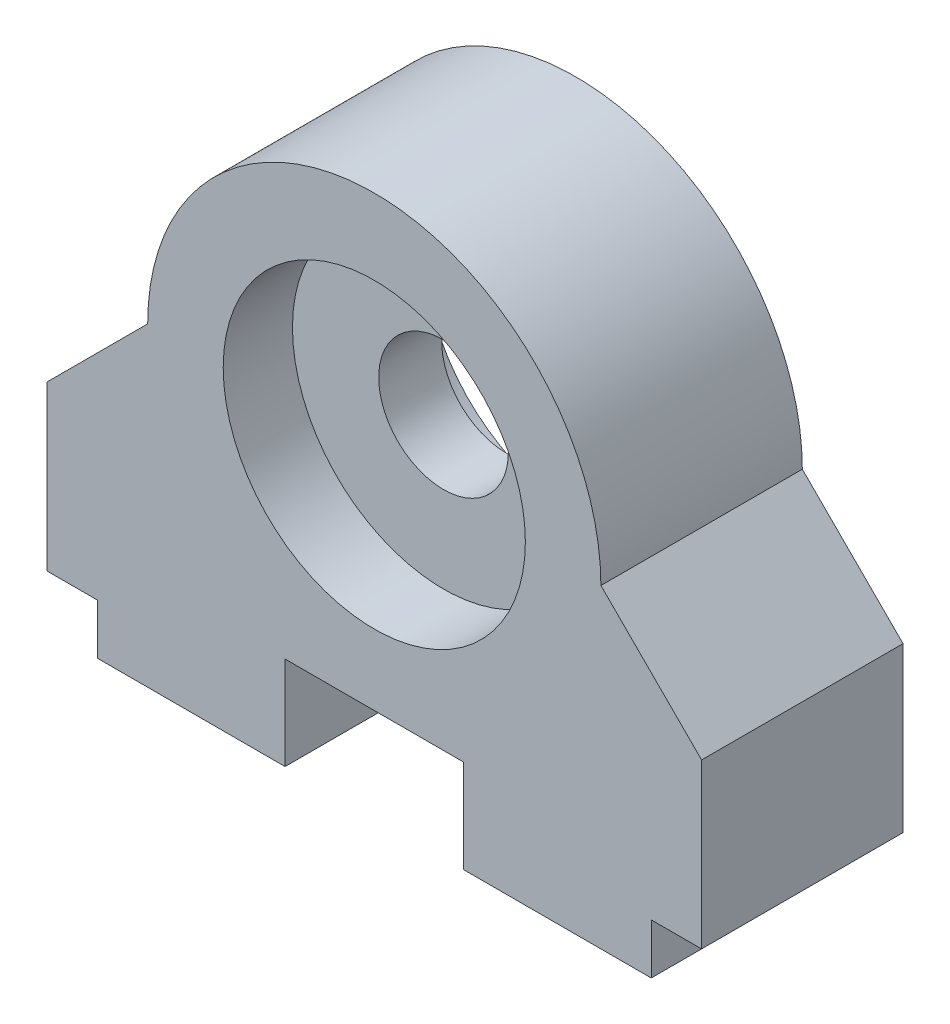
ISO-10303-21;
HEADER;
FILE_DESCRIPTION(('STEP AP214'),'2;1');
FILE_NAME('part.step','',(''),(''),'','','');
FILE_SCHEMA(('AUTOMOTIVE_DESIGN { 1 0 10303 214 1 1 1 1 }'));
ENDSEC;
DATA;
#1=APPLICATION_CONTEXT('core data for automotive mechanical design processes');
#2=APPLICATION_PROTOCOL_DEFINITION('international standard','automotive_design',2000,#1);
#3=PRODUCT_CONTEXT('',#1,'mechanical');
#4=PRODUCT('Part','Part','',(#3));
#5=PRODUCT_RELATED_PRODUCT_CATEGORY('part','',(#4));
#6=PRODUCT_DEFINITION_FORMATION('','',#4);
#7=PRODUCT_DEFINITION_CONTEXT('part definition',#1,'design');
#8=PRODUCT_DEFINITION('design','',#6,#7);
#9=PRODUCT_DEFINITION_SHAPE('','',#8);
#10=(LENGTH_UNIT() NAMED_UNIT(*) SI_UNIT(.MILLI.,.METRE.));
#11=(NAMED_UNIT(*) PLANE_ANGLE_UNIT() SI_UNIT($,.RADIAN.));
#12=(NAMED_UNIT(*) SI_UNIT($,.STERADIAN.) SOLID_ANGLE_UNIT());
#13=UNCERTAINTY_MEASURE_WITH_UNIT(LENGTH_MEASURE(1.E-05),#10,'distance_accuracy_value','');
#14=(GEOMETRIC_REPRESENTATION_CONTEXT(3) GLOBAL_UNCERTAINTY_ASSIGNED_CONTEXT((#13)) GLOBAL_UNIT_ASSIGNED_CONTEXT((#10,
#11,#12)) REPRESENTATION_CONTEXT('',''));
#15=CARTESIAN_POINT('',(0.,0.,0.));
#16=DIRECTION('',(0.,0.,1.));
#17=DIRECTION('',(1.,0.,0.));
#18=AXIS2_PLACEMENT_3D('',#15,#16,#17);
#19=CARTESIAN_POINT('',(0.,15.875,10.16));
#20=DIRECTION('',(0.,0.,-1.));
#21=DIRECTION('',(-1.,0.,0.));
#22=AXIS2_PLACEMENT_3D('',#19,#20,#21);
#23=CYLINDRICAL_SURFACE('',#22,7.62);
#24=CARTESIAN_POINT('',(0.,15.875,0.));
#25=DIRECTION('',(0.,0.,1.));
#26=DIRECTION('',(1.,0.,0.));
#27=AXIS2_PLACEMENT_3D('',#24,#25,#26);
#28=CIRCLE('',#27,7.62);
#29=CARTESIAN_POINT('',(7.62,15.875,0.));
#30=VERTEX_POINT('',#29);
#31=EDGE_CURVE('E330',#30,#30,#28,.T.);
#32=ORIENTED_EDGE('',*,*,#31,.F.);
#33=EDGE_LOOP('',(#32));
#34=FACE_BOUND('',#33,.T.);
#35=CARTESIAN_POINT('',(0.,15.875,3.4925));
#36=DIRECTION('',(0.,0.,1.));
#37=DIRECTION('',(1.,0.,0.));
#38=AXIS2_PLACEMENT_3D('',#35,#36,#37);
#39=CIRCLE('',#38,7.62);
#40=CARTESIAN_POINT('',(7.62,15.875,3.4925));
#41=VERTEX_POINT('',#40);
#42=EDGE_CURVE('E37',#41,#41,#39,.T.);
#43=ORIENTED_EDGE('',*,*,#42,.T.);
#44=EDGE_LOOP('',(#43));
#45=FACE_BOUND('',#44,.T.);
#46=ADVANCED_FACE('F33',(#34,#45),#23,.F.);
#47=CARTESIAN_POINT('',(0.,15.875,10.16));
#48=DIRECTION('',(0.,0.,-1.));
#49=DIRECTION('',(-1.,0.,0.));
#50=AXIS2_PLACEMENT_3D('',#47,#48,#49);
#51=PLANE('',#50);
#52=DIRECTION('',(0.,-1.,0.));
#53=VECTOR('',#52,1.);
#54=CARTESIAN_POINT('',(-13.97,0.,10.16));
#55=LINE('',#54,#53);
#56=CARTESIAN_POINT('',(-13.97,2.54,10.16));
#57=VERTEX_POINT('',#56);
#58=CARTESIAN_POINT('',(-13.97,0.,10.16));
#59=VERTEX_POINT('',#58);
#60=EDGE_CURVE('E196',#57,#59,#55,.T.);
#61=ORIENTED_EDGE('',*,*,#60,.T.);
#62=DIRECTION('',(1.,0.,0.));
#63=VECTOR('',#62,1.);
#64=CARTESIAN_POINT('',(-4.5,0.,10.16));
#65=LINE('',#64,#63);
#66=CARTESIAN_POINT('',(-4.5,0.,10.16));
#67=VERTEX_POINT('',#66);
#68=EDGE_CURVE('E113',#59,#67,#65,.T.);
#69=ORIENTED_EDGE('',*,*,#68,.T.);
#70=DIRECTION('',(0.,1.,0.));
#71=VECTOR('',#70,1.);
#72=CARTESIAN_POINT('',(-4.5,4.699,10.16));
#73=LINE('',#72,#71);
#74=CARTESIAN_POINT('',(-4.5,4.699,10.16));
#75=VERTEX_POINT('',#74);
#76=EDGE_CURVE('E249',#67,#75,#73,.T.);
#77=ORIENTED_EDGE('',*,*,#76,.T.);
#78=DIRECTION('',(1.,0.,0.));
#79=VECTOR('',#78,1.);
#80=CARTESIAN_POINT('',(4.5,4.699,10.16));
#81=LINE('',#80,#79);
#82=CARTESIAN_POINT('',(4.5,4.699,10.16));
#83=VERTEX_POINT('',#82);
#84=EDGE_CURVE('E246',#75,#83,#81,.T.);
#85=ORIENTED_EDGE('',*,*,#84,.T.);
#86=DIRECTION('',(0.,-1.,0.));
#87=VECTOR('',#86,1.);
#88=CARTESIAN_POINT('',(4.5,4.699,10.16));
#89=LINE('',#88,#87);
#90=CARTESIAN_POINT('',(4.5,0.,10.16));
#91=VERTEX_POINT('',#90);
#92=EDGE_CURVE('E248',#83,#91,#89,.T.);
#93=ORIENTED_EDGE('',*,*,#92,.T.);
#94=DIRECTION('',(1.,0.,0.));
#95=VECTOR('',#94,1.);
#96=CARTESIAN_POINT('',(4.5,0.,10.16));
#97=LINE('',#96,#95);
#98=CARTESIAN_POINT('',(13.97,0.,10.16));
#99=VERTEX_POINT('',#98);
#100=EDGE_CURVE('E251',#91,#99,#97,.T.);
#101=ORIENTED_EDGE('',*,*,#100,.T.);
#102=DIRECTION('',(0.,1.,0.));
#103=VECTOR('',#102,1.);
#104=CARTESIAN_POINT('',(13.97,0.,10.16));
#105=LINE('',#104,#103);
#106=CARTESIAN_POINT('',(13.97,2.54,10.16));
#107=VERTEX_POINT('',#106);
#108=EDGE_CURVE('E257',#99,#107,#105,.T.);
#109=ORIENTED_EDGE('',*,*,#108,.T.);
#110=DIRECTION('',(1.,0.,0.));
#111=VECTOR('',#110,1.);
#112=CARTESIAN_POINT('',(16.51,2.54,10.16));
#113=LINE('',#112,#111);
#114=CARTESIAN_POINT('',(16.51,2.54,10.16));
#115=VERTEX_POINT('',#114);
#116=EDGE_CURVE('E259',#107,#115,#113,.T.);
#117=ORIENTED_EDGE('',*,*,#116,.T.);
#118=DIRECTION('',(0.,1.,0.));
#119=VECTOR('',#118,1.);
#120=CARTESIAN_POINT('',(16.51,2.54,10.16));
#121=LINE('',#120,#119);
#122=CARTESIAN_POINT('',(16.51,10.795,10.16));
#123=VERTEX_POINT('',#122);
#124=EDGE_CURVE('E261',#115,#123,#121,.T.);
#125=ORIENTED_EDGE('',*,*,#124,.T.);
#126=DIRECTION('',(-0.707106781186549,0.707106781186546,0.));
#127=VECTOR('',#126,1.);
#128=CARTESIAN_POINT('',(16.51,10.795,10.16));
#129=LINE('',#128,#127);
#130=CARTESIAN_POINT('',(11.43,15.875,10.16));
#131=VERTEX_POINT('',#130);
#132=EDGE_CURVE('E263',#123,#131,#129,.T.);
#133=ORIENTED_EDGE('',*,*,#132,.T.);
#134=CARTESIAN_POINT('',(0.,15.875,10.16));
#135=DIRECTION('',(0.,0.,1.));
#136=DIRECTION('',(-1.,0.,0.));
#137=AXIS2_PLACEMENT_3D('',#134,#135,#136);
#138=CIRCLE('',#137,11.43);
#139=CARTESIAN_POINT('',(-11.43,15.875,10.16));
#140=VERTEX_POINT('',#139);
#141=EDGE_CURVE('E151',#131,#140,#138,.T.);
#142=ORIENTED_EDGE('',*,*,#141,.T.);
#143=DIRECTION('',(-0.707106781186549,-0.707106781186546,0.));
#144=VECTOR('',#143,1.);
#145=CARTESIAN_POINT('',(-16.51,10.795,10.16));
#146=LINE('',#145,#144);
#147=CARTESIAN_POINT('',(-16.51,10.795,10.16));
#148=VERTEX_POINT('',#147);
#149=EDGE_CURVE('E144',#140,#148,#146,.T.);
#150=ORIENTED_EDGE('',*,*,#149,.T.);
#151=DIRECTION('',(0.,-1.,0.));
#152=VECTOR('',#151,1.);
#153=CARTESIAN_POINT('',(-16.51,2.54,10.16));
#154=LINE('',#153,#152);
#155=CARTESIAN_POINT('',(-16.51,2.54,10.16));
#156=VERTEX_POINT('',#155);
#157=EDGE_CURVE('E149',#148,#156,#154,.T.);
#158=ORIENTED_EDGE('',*,*,#157,.T.);
#159=DIRECTION('',(1.,0.,0.));
#160=VECTOR('',#159,1.);
#161=CARTESIAN_POINT('',(-16.51,2.54,10.16));
#162=LINE('',#161,#160);
#163=EDGE_CURVE('E51',#156,#57,#162,.T.);
#164=ORIENTED_EDGE('',*,*,#163,.T.);
#165=EDGE_LOOP('',(#61,#69,#77,#85,#93,#101,#109,#117,#125,#133,#142,#150,#158,#164));
#166=FACE_BOUND('',#165,.T.);
#167=CARTESIAN_POINT('',(0.,15.875,10.16));
#168=DIRECTION('',(0.,0.,1.));
#169=DIRECTION('',(1.,0.,0.));
#170=AXIS2_PLACEMENT_3D('',#167,#168,#169);
#171=CIRCLE('',#170,7.62);
#172=CARTESIAN_POINT('',(7.62,15.875,10.16));
#173=VERTEX_POINT('',#172);
#174=EDGE_CURVE('E173',#173,#173,#171,.T.);
#175=ORIENTED_EDGE('',*,*,#174,.F.);
#176=EDGE_LOOP('',(#175));
#177=FACE_BOUND('',#176,.T.);
#178=ADVANCED_FACE('F146',(#166,#177),#51,.F.);
#179=CARTESIAN_POINT('',(0.,15.875,0.));
#180=DIRECTION('',(0.,0.,-1.));
#181=DIRECTION('',(-1.,0.,0.));
#182=AXIS2_PLACEMENT_3D('',#179,#180,#181);
#183=PLANE('',#182);
#184=DIRECTION('',(0.,-1.,0.));
#185=VECTOR('',#184,1.);
#186=CARTESIAN_POINT('',(-13.97,0.,0.));
#187=LINE('',#186,#185);
#188=CARTESIAN_POINT('',(-13.97,2.54,0.));
#189=VERTEX_POINT('',#188);
#190=CARTESIAN_POINT('',(-13.97,0.,0.));
#191=VERTEX_POINT('',#190);
#192=EDGE_CURVE('E169',#189,#191,#187,.T.);
#193=ORIENTED_EDGE('',*,*,#192,.F.);
#194=DIRECTION('',(1.,0.,0.));
#195=VECTOR('',#194,1.);
#196=CARTESIAN_POINT('',(-16.51,2.54,0.));
#197=LINE('',#196,#195);
#198=CARTESIAN_POINT('',(-16.51,2.54,0.));
#199=VERTEX_POINT('',#198);
#200=EDGE_CURVE('E104',#199,#189,#197,.T.);
#201=ORIENTED_EDGE('',*,*,#200,.F.);
#202=DIRECTION('',(0.,-1.,0.));
#203=VECTOR('',#202,1.);
#204=CARTESIAN_POINT('',(-16.51,2.54,0.));
#205=LINE('',#204,#203);
#206=CARTESIAN_POINT('',(-16.51,10.795,0.));
#207=VERTEX_POINT('',#206);
#208=EDGE_CURVE('E98',#207,#199,#205,.T.);
#209=ORIENTED_EDGE('',*,*,#208,.F.);
#210=DIRECTION('',(-0.707106781186549,-0.707106781186546,0.));
#211=VECTOR('',#210,1.);
#212=CARTESIAN_POINT('',(-16.51,10.795,0.));
#213=LINE('',#212,#211);
#214=CARTESIAN_POINT('',(-11.43,15.875,0.));
#215=VERTEX_POINT('',#214);
#216=EDGE_CURVE('E159',#215,#207,#213,.T.);
#217=ORIENTED_EDGE('',*,*,#216,.F.);
#218=CARTESIAN_POINT('',(0.,15.875,0.));
#219=DIRECTION('',(0.,0.,1.));
#220=DIRECTION('',(-1.,0.,0.));
#221=AXIS2_PLACEMENT_3D('',#218,#219,#220);
#222=CIRCLE('',#221,11.43);
#223=CARTESIAN_POINT('',(11.43,15.875,0.));
#224=VERTEX_POINT('',#223);
#225=EDGE_CURVE('E191',#224,#215,#222,.T.);
#226=ORIENTED_EDGE('',*,*,#225,.F.);
#227=DIRECTION('',(-0.707106781186549,0.707106781186546,0.));
#228=VECTOR('',#227,1.);
#229=CARTESIAN_POINT('',(16.51,10.795,0.));
#230=LINE('',#229,#228);
#231=CARTESIAN_POINT('',(16.51,10.795,0.));
#232=VERTEX_POINT('',#231);
#233=EDGE_CURVE('E189',#232,#224,#230,.T.);
#234=ORIENTED_EDGE('',*,*,#233,.F.);
#235=DIRECTION('',(0.,1.,0.));
#236=VECTOR('',#235,1.);
#237=CARTESIAN_POINT('',(16.51,2.54,0.));
#238=LINE('',#237,#236);
#239=CARTESIAN_POINT('',(16.51,2.54,0.));
#240=VERTEX_POINT('',#239);
#241=EDGE_CURVE('E187',#240,#232,#238,.T.);
#242=ORIENTED_EDGE('',*,*,#241,.F.);
#243=DIRECTION('',(1.,0.,0.));
#244=VECTOR('',#243,1.);
#245=CARTESIAN_POINT('',(16.51,2.54,0.));
#246=LINE('',#245,#244);
#247=CARTESIAN_POINT('',(13.97,2.54,0.));
#248=VERTEX_POINT('',#247);
#249=EDGE_CURVE('E185',#248,#240,#246,.T.);
#250=ORIENTED_EDGE('',*,*,#249,.F.);
#251=DIRECTION('',(0.,1.,0.));
#252=VECTOR('',#251,1.);
#253=CARTESIAN_POINT('',(13.97,0.,0.));
#254=LINE('',#253,#252);
#255=CARTESIAN_POINT('',(13.97,0.,0.));
#256=VERTEX_POINT('',#255);
#257=EDGE_CURVE('E183',#256,#248,#254,.T.);
#258=ORIENTED_EDGE('',*,*,#257,.F.);
#259=DIRECTION('',(1.,0.,0.));
#260=VECTOR('',#259,1.);
#261=CARTESIAN_POINT('',(4.5,0.,0.));
#262=LINE('',#261,#260);
#263=CARTESIAN_POINT('',(4.5,0.,0.));
#264=VERTEX_POINT('',#263);
#265=EDGE_CURVE('E181',#264,#256,#262,.T.);
#266=ORIENTED_EDGE('',*,*,#265,.F.);
#267=DIRECTION('',(0.,-1.,0.));
#268=VECTOR('',#267,1.);
#269=CARTESIAN_POINT('',(4.5,4.699,0.));
#270=LINE('',#269,#268);
#271=CARTESIAN_POINT('',(4.5,4.699,0.));
#272=VERTEX_POINT('',#271);
#273=EDGE_CURVE('E179',#272,#264,#270,.T.);
#274=ORIENTED_EDGE('',*,*,#273,.F.);
#275=DIRECTION('',(1.,0.,0.));
#276=VECTOR('',#275,1.);
#277=CARTESIAN_POINT('',(4.5,4.699,0.));
#278=LINE('',#277,#276);
#279=CARTESIAN_POINT('',(-4.5,4.699,0.));
#280=VERTEX_POINT('',#279);
#281=EDGE_CURVE('E177',#280,#272,#278,.T.);
#282=ORIENTED_EDGE('',*,*,#281,.F.);
#283=DIRECTION('',(0.,1.,0.));
#284=VECTOR('',#283,1.);
#285=CARTESIAN_POINT('',(-4.5,4.699,0.));
#286=LINE('',#285,#284);
#287=CARTESIAN_POINT('',(-4.5,0.,0.));
#288=VERTEX_POINT('',#287);
#289=EDGE_CURVE('E175',#288,#280,#286,.T.);
#290=ORIENTED_EDGE('',*,*,#289,.F.);
#291=DIRECTION('',(1.,0.,0.));
#292=VECTOR('',#291,1.);
#293=CARTESIAN_POINT('',(-4.5,0.,0.));
#294=LINE('',#293,#292);
#295=EDGE_CURVE('E172',#191,#288,#294,.T.);
#296=ORIENTED_EDGE('',*,*,#295,.F.);
#297=EDGE_LOOP('',(#193,#201,#209,#217,#226,#234,#242,#250,#258,#266,#274,#282,#290,#296));
#298=FACE_BOUND('',#297,.T.);
#299=ORIENTED_EDGE('',*,*,#31,.T.);
#300=EDGE_LOOP('',(#299));
#301=FACE_BOUND('',#300,.T.);
#302=ADVANCED_FACE('F233',(#298,#301),#183,.T.);
#303=CARTESIAN_POINT('',(-13.97,0.,10.16));
#304=DIRECTION('',(1.,0.,0.));
#305=DIRECTION('',(0.,0.,-1.));
#306=AXIS2_PLACEMENT_3D('',#303,#304,#305);
#307=PLANE('',#306);
#308=ORIENTED_EDGE('',*,*,#192,.T.);
#309=DIRECTION('',(0.,0.,-1.));
#310=VECTOR('',#309,1.);
#311=CARTESIAN_POINT('',(-13.97,0.,10.16));
#312=LINE('',#311,#310);
#313=EDGE_CURVE('E43',#59,#191,#312,.T.);
#314=ORIENTED_EDGE('',*,*,#313,.F.);
#315=ORIENTED_EDGE('',*,*,#60,.F.);
#316=DIRECTION('',(0.,0.,-1.));
#317=VECTOR('',#316,1.);
#318=CARTESIAN_POINT('',(-13.97,2.54,10.16));
#319=LINE('',#318,#317);
#320=EDGE_CURVE('E165',#57,#189,#319,.T.);
#321=ORIENTED_EDGE('',*,*,#320,.T.);
#322=EDGE_LOOP('',(#308,#314,#315,#321));
#323=FACE_BOUND('',#322,.T.);
#324=ADVANCED_FACE('F35',(#323),#307,.F.);
#325=CARTESIAN_POINT('',(-4.5,0.,10.16));
#326=DIRECTION('',(0.,1.,0.));
#327=DIRECTION('',(-1.,0.,0.));
#328=AXIS2_PLACEMENT_3D('',#325,#326,#327);
#329=PLANE('',#328);
#330=CARTESIAN_POINT('',(-10.16,0.,3.81));
#331=DIRECTION('',(0.,-1.,0.));
#332=DIRECTION('',(-1.,0.,0.));
#333=AXIS2_PLACEMENT_3D('',#330,#331,#332);
#334=CIRCLE('',#333,1.98374);
#335=CARTESIAN_POINT('',(-12.14374,0.,3.81));
#336=VERTEX_POINT('',#335);
#337=EDGE_CURVE('E349',#336,#336,#334,.T.);
#338=ORIENTED_EDGE('',*,*,#337,.F.);
#339=EDGE_LOOP('',(#338));
#340=FACE_BOUND('',#339,.T.);
#341=ORIENTED_EDGE('',*,*,#295,.T.);
#342=DIRECTION('',(0.,0.,-1.));
#343=VECTOR('',#342,1.);
#344=CARTESIAN_POINT('',(-4.5,0.,10.16));
#345=LINE('',#344,#343);
#346=EDGE_CURVE('E224',#67,#288,#345,.T.);
#347=ORIENTED_EDGE('',*,*,#346,.F.);
#348=ORIENTED_EDGE('',*,*,#68,.F.);
#349=ORIENTED_EDGE('',*,*,#313,.T.);
#350=EDGE_LOOP('',(#341,#347,#348,#349));
#351=FACE_BOUND('',#350,.T.);
#352=ADVANCED_FACE('F228',(#340,#351),#329,.F.);
#353=CARTESIAN_POINT('',(-4.5,4.699,10.16));
#354=DIRECTION('',(-1.,0.,0.));
#355=DIRECTION('',(0.,0.,1.));
#356=AXIS2_PLACEMENT_3D('',#353,#354,#355);
#357=PLANE('',#356);
#358=ORIENTED_EDGE('',*,*,#289,.T.);
#359=DIRECTION('',(0.,0.,-1.));
#360=VECTOR('',#359,1.);
#361=CARTESIAN_POINT('',(-4.5,4.699,10.16));
#362=LINE('',#361,#360);
#363=EDGE_CURVE('E221',#75,#280,#362,.T.);
#364=ORIENTED_EDGE('',*,*,#363,.F.);
#365=ORIENTED_EDGE('',*,*,#76,.F.);
#366=ORIENTED_EDGE('',*,*,#346,.T.);
#367=EDGE_LOOP('',(#358,#364,#365,#366));
#368=FACE_BOUND('',#367,.T.);
#369=ADVANCED_FACE('F240',(#368),#357,.F.);
#370=CARTESIAN_POINT('',(4.5,4.699,10.16));
#371=DIRECTION('',(0.,1.,0.));
#372=DIRECTION('',(0.,0.,1.));
#373=AXIS2_PLACEMENT_3D('',#370,#371,#372);
#374=PLANE('',#373);
#375=ORIENTED_EDGE('',*,*,#281,.T.);
#376=DIRECTION('',(0.,0.,-1.));
#377=VECTOR('',#376,1.);
#378=CARTESIAN_POINT('',(4.5,4.699,10.16));
#379=LINE('',#378,#377);
#380=EDGE_CURVE('E218',#83,#272,#379,.T.);
#381=ORIENTED_EDGE('',*,*,#380,.F.);
#382=ORIENTED_EDGE('',*,*,#84,.F.);
#383=ORIENTED_EDGE('',*,*,#363,.T.);
#384=EDGE_LOOP('',(#375,#381,#382,#383));
#385=FACE_BOUND('',#384,.T.);
#386=ADVANCED_FACE('F244',(#385),#374,.F.);
#387=CARTESIAN_POINT('',(4.5,4.699,10.16));
#388=DIRECTION('',(1.,0.,0.));
#389=DIRECTION('',(0.,0.,-1.));
#390=AXIS2_PLACEMENT_3D('',#387,#388,#389);
#391=PLANE('',#390);
#392=ORIENTED_EDGE('',*,*,#273,.T.);
#393=DIRECTION('',(0.,0.,-1.));
#394=VECTOR('',#393,1.);
#395=CARTESIAN_POINT('',(4.5,0.,10.16));
#396=LINE('',#395,#394);
#397=EDGE_CURVE('E215',#91,#264,#396,.T.);
#398=ORIENTED_EDGE('',*,*,#397,.F.);
#399=ORIENTED_EDGE('',*,*,#92,.F.);
#400=ORIENTED_EDGE('',*,*,#380,.T.);
#401=EDGE_LOOP('',(#392,#398,#399,#400));
#402=FACE_BOUND('',#401,.T.);
#403=ADVANCED_FACE('F294',(#402),#391,.F.);
#404=CARTESIAN_POINT('',(4.5,0.,10.16));
#405=DIRECTION('',(0.,1.,0.));
#406=DIRECTION('',(-1.,0.,0.));
#407=AXIS2_PLACEMENT_3D('',#404,#405,#406);
#408=PLANE('',#407);
#409=CARTESIAN_POINT('',(10.16,0.,3.81));
#410=DIRECTION('',(0.,-1.,0.));
#411=DIRECTION('',(1.,0.,0.));
#412=AXIS2_PLACEMENT_3D('',#409,#410,#411);
#413=CIRCLE('',#412,1.98374);
#414=CARTESIAN_POINT('',(12.14374,0.,3.81));
#415=VERTEX_POINT('',#414);
#416=EDGE_CURVE('E343',#415,#415,#413,.T.);
#417=ORIENTED_EDGE('',*,*,#416,.F.);
#418=EDGE_LOOP('',(#417));
#419=FACE_BOUND('',#418,.T.);
#420=ORIENTED_EDGE('',*,*,#265,.T.);
#421=DIRECTION('',(0.,0.,-1.));
#422=VECTOR('',#421,1.);
#423=CARTESIAN_POINT('',(13.97,0.,10.16));
#424=LINE('',#423,#422);
#425=EDGE_CURVE('E212',#99,#256,#424,.T.);
#426=ORIENTED_EDGE('',*,*,#425,.F.);
#427=ORIENTED_EDGE('',*,*,#100,.F.);
#428=ORIENTED_EDGE('',*,*,#397,.T.);
#429=EDGE_LOOP('',(#420,#426,#427,#428));
#430=FACE_BOUND('',#429,.T.);
#431=ADVANCED_FACE('F290',(#419,#430),#408,.F.);
#432=CARTESIAN_POINT('',(13.97,0.,10.16));
#433=DIRECTION('',(-1.,0.,0.));
#434=DIRECTION('',(0.,0.,1.));
#435=AXIS2_PLACEMENT_3D('',#432,#433,#434);
#436=PLANE('',#435);
#437=ORIENTED_EDGE('',*,*,#257,.T.);
#438=DIRECTION('',(0.,0.,-1.));
#439=VECTOR('',#438,1.);
#440=CARTESIAN_POINT('',(13.97,2.54,10.16));
#441=LINE('',#440,#439);
#442=EDGE_CURVE('E209',#107,#248,#441,.T.);
#443=ORIENTED_EDGE('',*,*,#442,.F.);
#444=ORIENTED_EDGE('',*,*,#108,.F.);
#445=ORIENTED_EDGE('',*,*,#425,.T.);
#446=EDGE_LOOP('',(#437,#443,#444,#445));
#447=FACE_BOUND('',#446,.T.);
#448=ADVANCED_FACE('F286',(#447),#436,.F.);
#449=CARTESIAN_POINT('',(16.51,2.54,10.16));
#450=DIRECTION('',(0.,1.,0.));
#451=DIRECTION('',(0.,0.,1.));
#452=AXIS2_PLACEMENT_3D('',#449,#450,#451);
#453=PLANE('',#452);
#454=ORIENTED_EDGE('',*,*,#249,.T.);
#455=DIRECTION('',(0.,0.,-1.));
#456=VECTOR('',#455,1.);
#457=CARTESIAN_POINT('',(16.51,2.54,10.16));
#458=LINE('',#457,#456);
#459=EDGE_CURVE('E206',#115,#240,#458,.T.);
#460=ORIENTED_EDGE('',*,*,#459,.F.);
#461=ORIENTED_EDGE('',*,*,#116,.F.);
#462=ORIENTED_EDGE('',*,*,#442,.T.);
#463=EDGE_LOOP('',(#454,#460,#461,#462));
#464=FACE_BOUND('',#463,.T.);
#465=ADVANCED_FACE('F282',(#464),#453,.F.);
#466=CARTESIAN_POINT('',(16.51,2.54,10.16));
#467=DIRECTION('',(-1.,0.,0.));
#468=DIRECTION('',(0.,0.,1.));
#469=AXIS2_PLACEMENT_3D('',#466,#467,#468);
#470=PLANE('',#469);
#471=ORIENTED_EDGE('',*,*,#241,.T.);
#472=DIRECTION('',(0.,0.,-1.));
#473=VECTOR('',#472,1.);
#474=CARTESIAN_POINT('',(16.51,10.795,10.16));
#475=LINE('',#474,#473);
#476=EDGE_CURVE('E203',#123,#232,#475,.T.);
#477=ORIENTED_EDGE('',*,*,#476,.F.);
#478=ORIENTED_EDGE('',*,*,#124,.F.);
#479=ORIENTED_EDGE('',*,*,#459,.T.);
#480=EDGE_LOOP('',(#471,#477,#478,#479));
#481=FACE_BOUND('',#480,.T.);
#482=ADVANCED_FACE('F278',(#481),#470,.F.);
#483=CARTESIAN_POINT('',(16.51,10.795,10.16));
#484=DIRECTION('',(-0.707106781186546,-0.707106781186549,0.));
#485=DIRECTION('',(0.707106781186549,-0.707106781186546,0.));
#486=AXIS2_PLACEMENT_3D('',#483,#484,#485);
#487=PLANE('',#486);
#488=ORIENTED_EDGE('',*,*,#233,.T.);
#489=DIRECTION('',(0.,0.,-1.));
#490=VECTOR('',#489,1.);
#491=CARTESIAN_POINT('',(11.43,15.875,10.16));
#492=LINE('',#491,#490);
#493=EDGE_CURVE('E200',#131,#224,#492,.T.);
#494=ORIENTED_EDGE('',*,*,#493,.F.);
#495=ORIENTED_EDGE('',*,*,#132,.F.);
#496=ORIENTED_EDGE('',*,*,#476,.T.);
#497=EDGE_LOOP('',(#488,#494,#495,#496));
#498=FACE_BOUND('',#497,.T.);
#499=ADVANCED_FACE('F269',(#498),#487,.F.);
#500=CARTESIAN_POINT('',(0.,15.875,10.16));
#501=DIRECTION('',(0.,0.,-1.));
#502=DIRECTION('',(-1.,0.,0.));
#503=AXIS2_PLACEMENT_3D('',#500,#501,#502);
#504=CYLINDRICAL_SURFACE('',#503,11.43);
#505=ORIENTED_EDGE('',*,*,#225,.T.);
#506=DIRECTION('',(0.,0.,-1.));
#507=VECTOR('',#506,1.);
#508=CARTESIAN_POINT('',(-11.43,15.875,10.16));
#509=LINE('',#508,#507);
#510=EDGE_CURVE('E160',#140,#215,#509,.T.);
#511=ORIENTED_EDGE('',*,*,#510,.F.);
#512=ORIENTED_EDGE('',*,*,#141,.F.);
#513=ORIENTED_EDGE('',*,*,#493,.T.);
#514=EDGE_LOOP('',(#505,#511,#512,#513));
#515=FACE_BOUND('',#514,.T.);
#516=ADVANCED_FACE('F273',(#515),#504,.T.);
#517=CARTESIAN_POINT('',(-16.51,10.795,10.16));
#518=DIRECTION('',(0.707106781186546,-0.707106781186549,0.));
#519=DIRECTION('',(0.707106781186549,0.707106781186546,0.));
#520=AXIS2_PLACEMENT_3D('',#517,#518,#519);
#521=PLANE('',#520);
#522=ORIENTED_EDGE('',*,*,#216,.T.);
#523=DIRECTION('',(0.,0.,-1.));
#524=VECTOR('',#523,1.);
#525=CARTESIAN_POINT('',(-16.51,10.795,10.16));
#526=LINE('',#525,#524);
#527=EDGE_CURVE('E156',#148,#207,#526,.T.);
#528=ORIENTED_EDGE('',*,*,#527,.F.);
#529=ORIENTED_EDGE('',*,*,#149,.F.);
#530=ORIENTED_EDGE('',*,*,#510,.T.);
#531=EDGE_LOOP('',(#522,#528,#529,#530));
#532=FACE_BOUND('',#531,.T.);
#533=ADVANCED_FACE('F157',(#532),#521,.F.);
#534=CARTESIAN_POINT('',(-16.51,2.54,10.16));
#535=DIRECTION('',(1.,0.,0.));
#536=DIRECTION('',(0.,0.,-1.));
#537=AXIS2_PLACEMENT_3D('',#534,#535,#536);
#538=PLANE('',#537);
#539=ORIENTED_EDGE('',*,*,#208,.T.);
#540=DIRECTION('',(0.,0.,-1.));
#541=VECTOR('',#540,1.);
#542=CARTESIAN_POINT('',(-16.51,2.54,10.16));
#543=LINE('',#542,#541);
#544=EDGE_CURVE('E161',#156,#199,#543,.T.);
#545=ORIENTED_EDGE('',*,*,#544,.F.);
#546=ORIENTED_EDGE('',*,*,#157,.F.);
#547=ORIENTED_EDGE('',*,*,#527,.T.);
#548=EDGE_LOOP('',(#539,#545,#546,#547));
#549=FACE_BOUND('',#548,.T.);
#550=ADVANCED_FACE('F163',(#549),#538,.F.);
#551=CARTESIAN_POINT('',(-16.51,2.54,10.16));
#552=DIRECTION('',(0.,1.,0.));
#553=DIRECTION('',(0.,0.,1.));
#554=AXIS2_PLACEMENT_3D('',#551,#552,#553);
#555=PLANE('',#554);
#556=ORIENTED_EDGE('',*,*,#200,.T.);
#557=ORIENTED_EDGE('',*,*,#320,.F.);
#558=ORIENTED_EDGE('',*,*,#163,.F.);
#559=ORIENTED_EDGE('',*,*,#544,.T.);
#560=EDGE_LOOP('',(#556,#557,#558,#559));
#561=FACE_BOUND('',#560,.T.);
#562=ADVANCED_FACE('F317',(#561),#555,.F.);
#563=CARTESIAN_POINT('',(0.,15.875,6.6675));
#564=DIRECTION('',(0.,0.,1.));
#565=DIRECTION('',(1.,0.,0.));
#566=AXIS2_PLACEMENT_3D('',#563,#564,#565);
#567=CIRCLE('',#566,7.62);
#568=CARTESIAN_POINT('',(7.62,15.875,6.6675));
#569=VERTEX_POINT('',#568);
#570=EDGE_CURVE('E11',#569,#569,#567,.T.);
#571=ORIENTED_EDGE('',*,*,#570,.F.);
#572=EDGE_LOOP('',(#571));
#573=FACE_BOUND('',#572,.T.);
#574=ORIENTED_EDGE('',*,*,#174,.T.);
#575=EDGE_LOOP('',(#574));
#576=FACE_BOUND('',#575,.T.);
#577=ADVANCED_FACE('F307',(#573,#576),#23,.F.);
#578=CARTESIAN_POINT('',(0.,15.875,3.4925));
#579=DIRECTION('',(0.,0.,1.));
#580=DIRECTION('',(1.,0.,0.));
#581=AXIS2_PLACEMENT_3D('',#578,#579,#580);
#582=PLANE('',#581);
#583=CARTESIAN_POINT('',(0.,15.875,3.4925));
#584=DIRECTION('',(0.,0.,1.));
#585=DIRECTION('',(1.,0.,0.));
#586=AXIS2_PLACEMENT_3D('',#583,#584,#585);
#587=CIRCLE('',#586,3.27025);
#588=CARTESIAN_POINT('',(3.27025,15.875,3.4925));
#589=VERTEX_POINT('',#588);
#590=EDGE_CURVE('E335',#589,#589,#587,.T.);
#591=ORIENTED_EDGE('',*,*,#590,.T.);
#592=EDGE_LOOP('',(#591));
#593=FACE_BOUND('',#592,.T.);
#594=ORIENTED_EDGE('',*,*,#42,.F.);
#595=EDGE_LOOP('',(#594));
#596=FACE_BOUND('',#595,.T.);
#597=ADVANCED_FACE('F316',(#593,#596),#582,.F.);
#598=CARTESIAN_POINT('',(0.,15.875,6.6675));
#599=DIRECTION('',(0.,0.,1.));
#600=DIRECTION('',(1.,0.,0.));
#601=AXIS2_PLACEMENT_3D('',#598,#599,#600);
#602=PLANE('',#601);
#603=CARTESIAN_POINT('',(0.,15.875,6.6675));
#604=DIRECTION('',(0.,0.,1.));
#605=DIRECTION('',(1.,0.,0.));
#606=AXIS2_PLACEMENT_3D('',#603,#604,#605);
#607=CIRCLE('',#606,3.27025);
#608=CARTESIAN_POINT('',(3.27025,15.875,6.6675));
#609=VERTEX_POINT('',#608);
#610=EDGE_CURVE('E339',#609,#609,#607,.T.);
#611=ORIENTED_EDGE('',*,*,#610,.F.);
#612=EDGE_LOOP('',(#611));
#613=FACE_BOUND('',#612,.T.);
#614=ORIENTED_EDGE('',*,*,#570,.T.);
#615=EDGE_LOOP('',(#614));
#616=FACE_BOUND('',#615,.T.);
#617=ADVANCED_FACE('F323',(#613,#616),#602,.T.);
#618=CARTESIAN_POINT('',(0.,15.875,3.4925));
#619=DIRECTION('',(0.,0.,1.));
#620=DIRECTION('',(1.,0.,0.));
#621=AXIS2_PLACEMENT_3D('',#618,#619,#620);
#622=CYLINDRICAL_SURFACE('',#621,3.27025);
#623=ORIENTED_EDGE('',*,*,#590,.F.);
#624=EDGE_LOOP('',(#623));
#625=FACE_BOUND('',#624,.T.);
#626=ORIENTED_EDGE('',*,*,#610,.T.);
#627=EDGE_LOOP('',(#626));
#628=FACE_BOUND('',#627,.T.);
#629=ADVANCED_FACE('F445',(#625,#628),#622,.F.);
#630=CARTESIAN_POINT('',(10.16,10.16,3.81));
#631=DIRECTION('',(0.,-1.,0.));
#632=DIRECTION('',(1.,0.,0.));
#633=AXIS2_PLACEMENT_3D('',#630,#631,#632);
#634=CYLINDRICAL_SURFACE('',#633,1.98374);
#635=CARTESIAN_POINT('',(10.16,10.16,3.81));
#636=DIRECTION('',(0.,-1.,0.));
#637=DIRECTION('',(1.,0.,0.));
#638=AXIS2_PLACEMENT_3D('',#635,#636,#637);
#639=CIRCLE('',#638,1.98374);
#640=CARTESIAN_POINT('',(12.14374,10.16,3.81));
#641=VERTEX_POINT('',#640);
#642=EDGE_CURVE('E342',#641,#641,#639,.T.);
#643=ORIENTED_EDGE('',*,*,#642,.F.);
#644=EDGE_LOOP('',(#643));
#645=FACE_BOUND('',#644,.T.);
#646=ORIENTED_EDGE('',*,*,#416,.T.);
#647=EDGE_LOOP('',(#646));
#648=FACE_BOUND('',#647,.T.);
#649=ADVANCED_FACE('F454',(#645,#648),#634,.F.);
#650=CARTESIAN_POINT('',(10.16,10.16,3.81));
#651=DIRECTION('',(0.,-1.,0.));
#652=DIRECTION('',(1.,0.,0.));
#653=AXIS2_PLACEMENT_3D('',#650,#651,#652);
#654=PLANE('',#653);
#655=ORIENTED_EDGE('',*,*,#642,.T.);
#656=EDGE_LOOP('',(#655));
#657=FACE_BOUND('',#656,.T.);
#658=ADVANCED_FACE('F360',(#657),#654,.T.);
#659=CARTESIAN_POINT('',(-10.16,10.16,3.81));
#660=DIRECTION('',(0.,-1.,0.));
#661=DIRECTION('',(1.,0.,0.));
#662=AXIS2_PLACEMENT_3D('',#659,#660,#661);
#663=CYLINDRICAL_SURFACE('',#662,1.98374);
#664=CARTESIAN_POINT('',(-10.16,10.16,3.81));
#665=DIRECTION('',(0.,-1.,0.));
#666=DIRECTION('',(-1.,0.,0.));
#667=AXIS2_PLACEMENT_3D('',#664,#665,#666);
#668=CIRCLE('',#667,1.98374);
#669=CARTESIAN_POINT('',(-12.14374,10.16,3.81));
#670=VERTEX_POINT('',#669);
#671=EDGE_CURVE('E346',#670,#670,#668,.T.);
#672=ORIENTED_EDGE('',*,*,#671,.F.);
#673=EDGE_LOOP('',(#672));
#674=FACE_BOUND('',#673,.T.);
#675=ORIENTED_EDGE('',*,*,#337,.T.);
#676=EDGE_LOOP('',(#675));
#677=FACE_BOUND('',#676,.T.);
#678=ADVANCED_FACE('F357',(#674,#677),#663,.F.);
#679=CARTESIAN_POINT('',(-10.16,10.16,3.81));
#680=DIRECTION('',(0.,1.,0.));
#681=DIRECTION('',(-1.,0.,0.));
#682=AXIS2_PLACEMENT_3D('',#679,#680,#681);
#683=PLANE('',#682);
#684=ORIENTED_EDGE('',*,*,#671,.T.);
#685=EDGE_LOOP('',(#684));
#686=FACE_BOUND('',#685,.T.);
#687=ADVANCED_FACE('F355',(#686),#683,.F.);
#688=CLOSED_SHELL('',(#46,#178,#302,#324,#352,#369,#386,#403,#431,#448,#465,#482,#499,#516,#533,
#550,#562,#577,#597,#617,#629,#649,#658,#678,#687));
#689=MANIFOLD_SOLID_BREP('B2',#688);
#690=ADVANCED_BREP_SHAPE_REPRESENTATION('',(#18,#689),#14);
#691=SHAPE_DEFINITION_REPRESENTATION(#9,#690);
ENDSEC;
END-ISO-10303-21;
